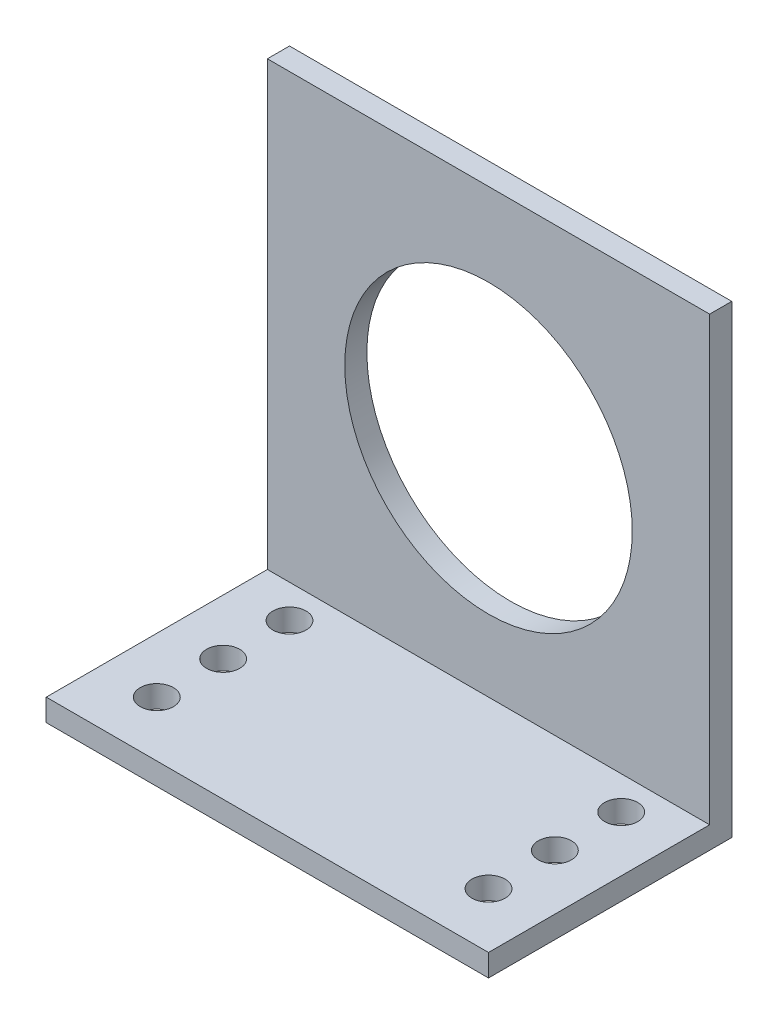
ISO-10303-21;
HEADER;
FILE_DESCRIPTION(('STEP AP214'),'2;1');
FILE_NAME('part.step','',(''),(''),'','','');
FILE_SCHEMA(('AUTOMOTIVE_DESIGN { 1 0 10303 214 1 1 1 1 }'));
ENDSEC;
DATA;
#1=APPLICATION_CONTEXT('core data for automotive mechanical design processes');
#2=APPLICATION_PROTOCOL_DEFINITION('international standard','automotive_design',2000,#1);
#3=PRODUCT_CONTEXT('',#1,'mechanical');
#4=PRODUCT('Part','Part','',(#3));
#5=PRODUCT_RELATED_PRODUCT_CATEGORY('part','',(#4));
#6=PRODUCT_DEFINITION_FORMATION('','',#4);
#7=PRODUCT_DEFINITION_CONTEXT('part definition',#1,'design');
#8=PRODUCT_DEFINITION('design','',#6,#7);
#9=PRODUCT_DEFINITION_SHAPE('','',#8);
#10=(LENGTH_UNIT() NAMED_UNIT(*) SI_UNIT(.MILLI.,.METRE.));
#11=(NAMED_UNIT(*) PLANE_ANGLE_UNIT() SI_UNIT($,.RADIAN.));
#12=(NAMED_UNIT(*) SI_UNIT($,.STERADIAN.) SOLID_ANGLE_UNIT());
#13=UNCERTAINTY_MEASURE_WITH_UNIT(LENGTH_MEASURE(1.E-05),#10,'distance_accuracy_value','');
#14=(GEOMETRIC_REPRESENTATION_CONTEXT(3) GLOBAL_UNCERTAINTY_ASSIGNED_CONTEXT((#13)) GLOBAL_UNIT_ASSIGNED_CONTEXT((#10,
#11,#12)) REPRESENTATION_CONTEXT('',''));
#15=CARTESIAN_POINT('',(0.,0.,0.));
#16=DIRECTION('',(0.,0.,1.));
#17=DIRECTION('',(1.,0.,0.));
#18=AXIS2_PLACEMENT_3D('',#15,#16,#17);
#19=CARTESIAN_POINT('',(40.,2.,0.));
#20=DIRECTION('',(0.,1.,0.));
#21=DIRECTION('',(0.,0.,1.));
#22=AXIS2_PLACEMENT_3D('',#19,#20,#21);
#23=PLANE('',#22);
#24=CARTESIAN_POINT('',(35.,2.,-17.));
#25=DIRECTION('',(0.,1.,0.));
#26=DIRECTION('',(0.,0.,1.));
#27=AXIS2_PLACEMENT_3D('',#24,#25,#26);
#28=CIRCLE('',#27,1.5);
#29=CARTESIAN_POINT('',(35.,2.,-15.5));
#30=VERTEX_POINT('',#29);
#31=EDGE_CURVE('E204',#30,#30,#28,.T.);
#32=ORIENTED_EDGE('',*,*,#31,.F.);
#33=EDGE_LOOP('',(#32));
#34=FACE_BOUND('',#33,.T.);
#35=CARTESIAN_POINT('',(35.,2.,-11.));
#36=DIRECTION('',(0.,1.,0.));
#37=DIRECTION('',(0.,0.,1.));
#38=AXIS2_PLACEMENT_3D('',#35,#36,#37);
#39=CIRCLE('',#38,1.5);
#40=CARTESIAN_POINT('',(35.,2.,-9.49999999999999));
#41=VERTEX_POINT('',#40);
#42=EDGE_CURVE('E198',#41,#41,#39,.T.);
#43=ORIENTED_EDGE('',*,*,#42,.F.);
#44=EDGE_LOOP('',(#43));
#45=FACE_BOUND('',#44,.T.);
#46=CARTESIAN_POINT('',(4.99999999999996,2.,-16.9999999999998));
#47=DIRECTION('',(0.,1.,0.));
#48=DIRECTION('',(0.,0.,1.));
#49=AXIS2_PLACEMENT_3D('',#46,#47,#48);
#50=CIRCLE('',#49,1.5);
#51=CARTESIAN_POINT('',(4.99999999999996,2.,-15.4999999999998));
#52=VERTEX_POINT('',#51);
#53=EDGE_CURVE('E192',#52,#52,#50,.T.);
#54=ORIENTED_EDGE('',*,*,#53,.F.);
#55=EDGE_LOOP('',(#54));
#56=FACE_BOUND('',#55,.T.);
#57=CARTESIAN_POINT('',(4.99999999999998,2.,-10.9999999999998));
#58=DIRECTION('',(0.,1.,0.));
#59=DIRECTION('',(0.,0.,1.));
#60=AXIS2_PLACEMENT_3D('',#57,#58,#59);
#61=CIRCLE('',#60,1.5);
#62=CARTESIAN_POINT('',(4.99999999999998,2.,-9.49999999999979));
#63=VERTEX_POINT('',#62);
#64=EDGE_CURVE('E186',#63,#63,#61,.T.);
#65=ORIENTED_EDGE('',*,*,#64,.F.);
#66=EDGE_LOOP('',(#65));
#67=FACE_BOUND('',#66,.T.);
#68=CARTESIAN_POINT('',(5.,2.,-4.99999999999979));
#69=DIRECTION('',(0.,1.,0.));
#70=DIRECTION('',(0.,0.,1.));
#71=AXIS2_PLACEMENT_3D('',#68,#69,#70);
#72=CIRCLE('',#71,1.5);
#73=CARTESIAN_POINT('',(5.,2.,-3.49999999999979));
#74=VERTEX_POINT('',#73);
#75=EDGE_CURVE('E180',#74,#74,#72,.T.);
#76=ORIENTED_EDGE('',*,*,#75,.F.);
#77=EDGE_LOOP('',(#76));
#78=FACE_BOUND('',#77,.T.);
#79=CARTESIAN_POINT('',(35.,2.,-5.));
#80=DIRECTION('',(0.,1.,0.));
#81=DIRECTION('',(0.,0.,1.));
#82=AXIS2_PLACEMENT_3D('',#79,#80,#81);
#83=CIRCLE('',#82,1.5);
#84=CARTESIAN_POINT('',(35.,2.,-3.5));
#85=VERTEX_POINT('',#84);
#86=EDGE_CURVE('E173',#85,#85,#83,.T.);
#87=ORIENTED_EDGE('',*,*,#86,.F.);
#88=EDGE_LOOP('',(#87));
#89=FACE_BOUND('',#88,.T.);
#90=DIRECTION('',(0.,0.,-1.));
#91=VECTOR('',#90,1.);
#92=CARTESIAN_POINT('',(0.,2.,0.));
#93=LINE('',#92,#91);
#94=CARTESIAN_POINT('',(0.,2.,0.));
#95=VERTEX_POINT('',#94);
#96=CARTESIAN_POINT('',(0.,2.,-20.));
#97=VERTEX_POINT('',#96);
#98=EDGE_CURVE('E116',#95,#97,#93,.T.);
#99=ORIENTED_EDGE('',*,*,#98,.F.);
#100=DIRECTION('',(-1.,0.,0.));
#101=VECTOR('',#100,1.);
#102=CARTESIAN_POINT('',(40.,2.,0.));
#103=LINE('',#102,#101);
#104=CARTESIAN_POINT('',(40.,2.,0.));
#105=VERTEX_POINT('',#104);
#106=EDGE_CURVE('E11',#105,#95,#103,.T.);
#107=ORIENTED_EDGE('',*,*,#106,.F.);
#108=DIRECTION('',(0.,0.,-1.));
#109=VECTOR('',#108,1.);
#110=CARTESIAN_POINT('',(40.,2.,0.));
#111=LINE('',#110,#109);
#112=CARTESIAN_POINT('',(40.,2.,-20.));
#113=VERTEX_POINT('',#112);
#114=EDGE_CURVE('E131',#105,#113,#111,.T.);
#115=ORIENTED_EDGE('',*,*,#114,.T.);
#116=DIRECTION('',(-1.,0.,0.));
#117=VECTOR('',#116,1.);
#118=CARTESIAN_POINT('',(40.,2.,-20.));
#119=LINE('',#118,#117);
#120=EDGE_CURVE('E35',#113,#97,#119,.T.);
#121=ORIENTED_EDGE('',*,*,#120,.T.);
#122=EDGE_LOOP('',(#99,#107,#115,#121));
#123=FACE_BOUND('',#122,.T.);
#124=ADVANCED_FACE('F32',(#34,#45,#56,#67,#78,#89,#123),#23,.T.);
#125=CARTESIAN_POINT('',(40.,0.,0.));
#126=DIRECTION('',(0.,0.,1.));
#127=DIRECTION('',(1.,0.,0.));
#128=AXIS2_PLACEMENT_3D('',#125,#126,#127);
#129=PLANE('',#128);
#130=DIRECTION('',(0.,1.,0.));
#131=VECTOR('',#130,1.);
#132=CARTESIAN_POINT('',(0.,0.,0.));
#133=LINE('',#132,#131);
#134=CARTESIAN_POINT('',(0.,0.,0.));
#135=VERTEX_POINT('',#134);
#136=EDGE_CURVE('E129',#135,#95,#133,.T.);
#137=ORIENTED_EDGE('',*,*,#136,.F.);
#138=DIRECTION('',(-1.,0.,0.));
#139=VECTOR('',#138,1.);
#140=CARTESIAN_POINT('',(40.,0.,0.));
#141=LINE('',#140,#139);
#142=CARTESIAN_POINT('',(40.,0.,0.));
#143=VERTEX_POINT('',#142);
#144=EDGE_CURVE('E41',#143,#135,#141,.T.);
#145=ORIENTED_EDGE('',*,*,#144,.F.);
#146=DIRECTION('',(0.,1.,0.));
#147=VECTOR('',#146,1.);
#148=CARTESIAN_POINT('',(40.,0.,0.));
#149=LINE('',#148,#147);
#150=EDGE_CURVE('E96',#143,#105,#149,.T.);
#151=ORIENTED_EDGE('',*,*,#150,.T.);
#152=ORIENTED_EDGE('',*,*,#106,.T.);
#153=EDGE_LOOP('',(#137,#145,#151,#152));
#154=FACE_BOUND('',#153,.T.);
#155=ADVANCED_FACE('F140',(#154),#129,.T.);
#156=CARTESIAN_POINT('',(40.,0.,0.));
#157=DIRECTION('',(0.,1.,0.));
#158=DIRECTION('',(0.,0.,1.));
#159=AXIS2_PLACEMENT_3D('',#156,#157,#158);
#160=PLANE('',#159);
#161=CARTESIAN_POINT('',(35.,0.,-17.));
#162=DIRECTION('',(0.,1.,0.));
#163=DIRECTION('',(0.,0.,1.));
#164=AXIS2_PLACEMENT_3D('',#161,#162,#163);
#165=CIRCLE('',#164,1.5);
#166=CARTESIAN_POINT('',(35.,0.,-15.5));
#167=VERTEX_POINT('',#166);
#168=EDGE_CURVE('E201',#167,#167,#165,.T.);
#169=ORIENTED_EDGE('',*,*,#168,.T.);
#170=EDGE_LOOP('',(#169));
#171=FACE_BOUND('',#170,.T.);
#172=CARTESIAN_POINT('',(35.,0.,-11.));
#173=DIRECTION('',(0.,1.,0.));
#174=DIRECTION('',(0.,0.,1.));
#175=AXIS2_PLACEMENT_3D('',#172,#173,#174);
#176=CIRCLE('',#175,1.5);
#177=CARTESIAN_POINT('',(35.,0.,-9.49999999999999));
#178=VERTEX_POINT('',#177);
#179=EDGE_CURVE('E195',#178,#178,#176,.T.);
#180=ORIENTED_EDGE('',*,*,#179,.T.);
#181=EDGE_LOOP('',(#180));
#182=FACE_BOUND('',#181,.T.);
#183=CARTESIAN_POINT('',(4.99999999999996,0.,-16.9999999999998));
#184=DIRECTION('',(0.,1.,0.));
#185=DIRECTION('',(0.,0.,1.));
#186=AXIS2_PLACEMENT_3D('',#183,#184,#185);
#187=CIRCLE('',#186,1.5);
#188=CARTESIAN_POINT('',(4.99999999999996,0.,-15.4999999999998));
#189=VERTEX_POINT('',#188);
#190=EDGE_CURVE('E189',#189,#189,#187,.T.);
#191=ORIENTED_EDGE('',*,*,#190,.T.);
#192=EDGE_LOOP('',(#191));
#193=FACE_BOUND('',#192,.T.);
#194=CARTESIAN_POINT('',(4.99999999999998,0.,-10.9999999999998));
#195=DIRECTION('',(0.,1.,0.));
#196=DIRECTION('',(0.,0.,1.));
#197=AXIS2_PLACEMENT_3D('',#194,#195,#196);
#198=CIRCLE('',#197,1.5);
#199=CARTESIAN_POINT('',(4.99999999999998,0.,-9.49999999999979));
#200=VERTEX_POINT('',#199);
#201=EDGE_CURVE('E183',#200,#200,#198,.T.);
#202=ORIENTED_EDGE('',*,*,#201,.T.);
#203=EDGE_LOOP('',(#202));
#204=FACE_BOUND('',#203,.T.);
#205=CARTESIAN_POINT('',(5.,0.,-4.99999999999979));
#206=DIRECTION('',(0.,1.,0.));
#207=DIRECTION('',(0.,0.,1.));
#208=AXIS2_PLACEMENT_3D('',#205,#206,#207);
#209=CIRCLE('',#208,1.5);
#210=CARTESIAN_POINT('',(5.,0.,-3.49999999999979));
#211=VERTEX_POINT('',#210);
#212=EDGE_CURVE('E178',#211,#211,#209,.T.);
#213=ORIENTED_EDGE('',*,*,#212,.T.);
#214=EDGE_LOOP('',(#213));
#215=FACE_BOUND('',#214,.T.);
#216=CARTESIAN_POINT('',(35.,0.,-5.));
#217=DIRECTION('',(0.,1.,0.));
#218=DIRECTION('',(0.,0.,1.));
#219=AXIS2_PLACEMENT_3D('',#216,#217,#218);
#220=CIRCLE('',#219,1.5);
#221=CARTESIAN_POINT('',(35.,0.,-3.5));
#222=VERTEX_POINT('',#221);
#223=EDGE_CURVE('E168',#222,#222,#220,.T.);
#224=ORIENTED_EDGE('',*,*,#223,.T.);
#225=EDGE_LOOP('',(#224));
#226=FACE_BOUND('',#225,.T.);
#227=DIRECTION('',(0.,0.,-1.));
#228=VECTOR('',#227,1.);
#229=CARTESIAN_POINT('',(0.,0.,0.));
#230=LINE('',#229,#228);
#231=CARTESIAN_POINT('',(0.,0.,-22.));
#232=VERTEX_POINT('',#231);
#233=EDGE_CURVE('E101',#135,#232,#230,.T.);
#234=ORIENTED_EDGE('',*,*,#233,.T.);
#235=DIRECTION('',(-1.,0.,0.));
#236=VECTOR('',#235,1.);
#237=CARTESIAN_POINT('',(40.,0.,-22.));
#238=LINE('',#237,#236);
#239=CARTESIAN_POINT('',(40.,0.,-22.));
#240=VERTEX_POINT('',#239);
#241=EDGE_CURVE('E99',#240,#232,#238,.T.);
#242=ORIENTED_EDGE('',*,*,#241,.F.);
#243=DIRECTION('',(0.,0.,-1.));
#244=VECTOR('',#243,1.);
#245=CARTESIAN_POINT('',(40.,0.,0.));
#246=LINE('',#245,#244);
#247=EDGE_CURVE('E90',#143,#240,#246,.T.);
#248=ORIENTED_EDGE('',*,*,#247,.F.);
#249=ORIENTED_EDGE('',*,*,#144,.T.);
#250=EDGE_LOOP('',(#234,#242,#248,#249));
#251=FACE_BOUND('',#250,.T.);
#252=ADVANCED_FACE('F100',(#171,#182,#193,#204,#215,#226,#251),#160,.F.);
#253=CARTESIAN_POINT('',(40.,0.,-22.));
#254=DIRECTION('',(0.,0.,1.));
#255=DIRECTION('',(1.,0.,0.));
#256=AXIS2_PLACEMENT_3D('',#253,#254,#255);
#257=PLANE('',#256);
#258=CARTESIAN_POINT('',(20.,21.5,-22.));
#259=DIRECTION('',(0.,0.,1.));
#260=DIRECTION('',(1.,0.,0.));
#261=AXIS2_PLACEMENT_3D('',#258,#259,#260);
#262=CIRCLE('',#261,13.);
#263=CARTESIAN_POINT('',(33.,21.5,-22.));
#264=VERTEX_POINT('',#263);
#265=EDGE_CURVE('E120',#264,#264,#262,.T.);
#266=ORIENTED_EDGE('',*,*,#265,.T.);
#267=EDGE_LOOP('',(#266));
#268=FACE_BOUND('',#267,.T.);
#269=DIRECTION('',(0.,1.,0.));
#270=VECTOR('',#269,1.);
#271=CARTESIAN_POINT('',(0.,0.,-22.));
#272=LINE('',#271,#270);
#273=CARTESIAN_POINT('',(0.,42.,-22.));
#274=VERTEX_POINT('',#273);
#275=EDGE_CURVE('E126',#232,#274,#272,.T.);
#276=ORIENTED_EDGE('',*,*,#275,.T.);
#277=DIRECTION('',(-1.,0.,0.));
#278=VECTOR('',#277,1.);
#279=CARTESIAN_POINT('',(40.,42.,-22.));
#280=LINE('',#279,#278);
#281=CARTESIAN_POINT('',(40.,42.,-22.));
#282=VERTEX_POINT('',#281);
#283=EDGE_CURVE('E104',#282,#274,#280,.T.);
#284=ORIENTED_EDGE('',*,*,#283,.F.);
#285=DIRECTION('',(0.,1.,0.));
#286=VECTOR('',#285,1.);
#287=CARTESIAN_POINT('',(40.,0.,-22.));
#288=LINE('',#287,#286);
#289=EDGE_CURVE('E94',#240,#282,#288,.T.);
#290=ORIENTED_EDGE('',*,*,#289,.F.);
#291=ORIENTED_EDGE('',*,*,#241,.T.);
#292=EDGE_LOOP('',(#276,#284,#290,#291));
#293=FACE_BOUND('',#292,.T.);
#294=ADVANCED_FACE('F106',(#268,#293),#257,.F.);
#295=CARTESIAN_POINT('',(40.,42.,-22.));
#296=DIRECTION('',(0.,-1.,0.));
#297=DIRECTION('',(0.,0.,-1.));
#298=AXIS2_PLACEMENT_3D('',#295,#296,#297);
#299=PLANE('',#298);
#300=DIRECTION('',(0.,0.,1.));
#301=VECTOR('',#300,1.);
#302=CARTESIAN_POINT('',(0.,42.,-22.));
#303=LINE('',#302,#301);
#304=CARTESIAN_POINT('',(0.,42.,-20.));
#305=VERTEX_POINT('',#304);
#306=EDGE_CURVE('E123',#274,#305,#303,.T.);
#307=ORIENTED_EDGE('',*,*,#306,.T.);
#308=DIRECTION('',(-1.,0.,0.));
#309=VECTOR('',#308,1.);
#310=CARTESIAN_POINT('',(40.,42.,-20.));
#311=LINE('',#310,#309);
#312=CARTESIAN_POINT('',(40.,42.,-20.));
#313=VERTEX_POINT('',#312);
#314=EDGE_CURVE('E134',#313,#305,#311,.T.);
#315=ORIENTED_EDGE('',*,*,#314,.F.);
#316=DIRECTION('',(0.,0.,1.));
#317=VECTOR('',#316,1.);
#318=CARTESIAN_POINT('',(40.,42.,-22.));
#319=LINE('',#318,#317);
#320=EDGE_CURVE('E109',#282,#313,#319,.T.);
#321=ORIENTED_EDGE('',*,*,#320,.F.);
#322=ORIENTED_EDGE('',*,*,#283,.T.);
#323=EDGE_LOOP('',(#307,#315,#321,#322));
#324=FACE_BOUND('',#323,.T.);
#325=ADVANCED_FACE('F155',(#324),#299,.F.);
#326=CARTESIAN_POINT('',(40.,2.,-20.));
#327=DIRECTION('',(0.,0.,1.));
#328=DIRECTION('',(1.,0.,0.));
#329=AXIS2_PLACEMENT_3D('',#326,#327,#328);
#330=PLANE('',#329);
#331=CARTESIAN_POINT('',(20.,21.5,-20.));
#332=DIRECTION('',(0.,0.,1.));
#333=DIRECTION('',(1.,0.,0.));
#334=AXIS2_PLACEMENT_3D('',#331,#332,#333);
#335=CIRCLE('',#334,13.);
#336=CARTESIAN_POINT('',(33.,21.5,-20.));
#337=VERTEX_POINT('',#336);
#338=EDGE_CURVE('E166',#337,#337,#335,.T.);
#339=ORIENTED_EDGE('',*,*,#338,.F.);
#340=EDGE_LOOP('',(#339));
#341=FACE_BOUND('',#340,.T.);
#342=DIRECTION('',(0.,1.,0.));
#343=VECTOR('',#342,1.);
#344=CARTESIAN_POINT('',(0.,2.,-20.));
#345=LINE('',#344,#343);
#346=EDGE_CURVE('E119',#97,#305,#345,.T.);
#347=ORIENTED_EDGE('',*,*,#346,.F.);
#348=ORIENTED_EDGE('',*,*,#120,.F.);
#349=DIRECTION('',(0.,1.,0.));
#350=VECTOR('',#349,1.);
#351=CARTESIAN_POINT('',(40.,2.,-20.));
#352=LINE('',#351,#350);
#353=EDGE_CURVE('E111',#113,#313,#352,.T.);
#354=ORIENTED_EDGE('',*,*,#353,.T.);
#355=ORIENTED_EDGE('',*,*,#314,.T.);
#356=EDGE_LOOP('',(#347,#348,#354,#355));
#357=FACE_BOUND('',#356,.T.);
#358=ADVANCED_FACE('F136',(#341,#357),#330,.T.);
#359=CARTESIAN_POINT('',(40.,0.,0.));
#360=DIRECTION('',(1.,0.,0.));
#361=DIRECTION('',(0.,0.,-1.));
#362=AXIS2_PLACEMENT_3D('',#359,#360,#361);
#363=PLANE('',#362);
#364=ORIENTED_EDGE('',*,*,#114,.F.);
#365=ORIENTED_EDGE('',*,*,#150,.F.);
#366=ORIENTED_EDGE('',*,*,#247,.T.);
#367=ORIENTED_EDGE('',*,*,#289,.T.);
#368=ORIENTED_EDGE('',*,*,#320,.T.);
#369=ORIENTED_EDGE('',*,*,#353,.F.);
#370=EDGE_LOOP('',(#364,#365,#366,#367,#368,#369));
#371=FACE_BOUND('',#370,.T.);
#372=ADVANCED_FACE('F92',(#371),#363,.T.);
#373=CARTESIAN_POINT('',(0.,0.,0.));
#374=DIRECTION('',(1.,0.,0.));
#375=DIRECTION('',(0.,0.,-1.));
#376=AXIS2_PLACEMENT_3D('',#373,#374,#375);
#377=PLANE('',#376);
#378=ORIENTED_EDGE('',*,*,#98,.T.);
#379=ORIENTED_EDGE('',*,*,#346,.T.);
#380=ORIENTED_EDGE('',*,*,#306,.F.);
#381=ORIENTED_EDGE('',*,*,#275,.F.);
#382=ORIENTED_EDGE('',*,*,#233,.F.);
#383=ORIENTED_EDGE('',*,*,#136,.T.);
#384=EDGE_LOOP('',(#378,#379,#380,#381,#382,#383));
#385=FACE_BOUND('',#384,.T.);
#386=ADVANCED_FACE('F139',(#385),#377,.F.);
#387=CARTESIAN_POINT('',(20.,21.5,-22.));
#388=DIRECTION('',(0.,0.,1.));
#389=DIRECTION('',(1.,0.,0.));
#390=AXIS2_PLACEMENT_3D('',#387,#388,#389);
#391=CYLINDRICAL_SURFACE('',#390,13.);
#392=ORIENTED_EDGE('',*,*,#265,.F.);
#393=EDGE_LOOP('',(#392));
#394=FACE_BOUND('',#393,.T.);
#395=ORIENTED_EDGE('',*,*,#338,.T.);
#396=EDGE_LOOP('',(#395));
#397=FACE_BOUND('',#396,.T.);
#398=ADVANCED_FACE('F231',(#394,#397),#391,.F.);
#399=CARTESIAN_POINT('',(35.,0.,-5.));
#400=DIRECTION('',(0.,1.,0.));
#401=DIRECTION('',(0.,0.,1.));
#402=AXIS2_PLACEMENT_3D('',#399,#400,#401);
#403=CYLINDRICAL_SURFACE('',#402,1.5);
#404=ORIENTED_EDGE('',*,*,#223,.F.);
#405=EDGE_LOOP('',(#404));
#406=FACE_BOUND('',#405,.T.);
#407=ORIENTED_EDGE('',*,*,#86,.T.);
#408=EDGE_LOOP('',(#407));
#409=FACE_BOUND('',#408,.T.);
#410=ADVANCED_FACE('F228',(#406,#409),#403,.F.);
#411=CARTESIAN_POINT('',(5.,0.,-4.99999999999979));
#412=DIRECTION('',(0.,1.,0.));
#413=DIRECTION('',(0.,0.,1.));
#414=AXIS2_PLACEMENT_3D('',#411,#412,#413);
#415=CYLINDRICAL_SURFACE('',#414,1.5);
#416=ORIENTED_EDGE('',*,*,#212,.F.);
#417=EDGE_LOOP('',(#416));
#418=FACE_BOUND('',#417,.T.);
#419=ORIENTED_EDGE('',*,*,#75,.T.);
#420=EDGE_LOOP('',(#419));
#421=FACE_BOUND('',#420,.T.);
#422=ADVANCED_FACE('F230',(#418,#421),#415,.F.);
#423=CARTESIAN_POINT('',(4.99999999999998,0.,-10.9999999999998));
#424=DIRECTION('',(0.,1.,0.));
#425=DIRECTION('',(0.,0.,1.));
#426=AXIS2_PLACEMENT_3D('',#423,#424,#425);
#427=CYLINDRICAL_SURFACE('',#426,1.5);
#428=ORIENTED_EDGE('',*,*,#201,.F.);
#429=EDGE_LOOP('',(#428));
#430=FACE_BOUND('',#429,.T.);
#431=ORIENTED_EDGE('',*,*,#64,.T.);
#432=EDGE_LOOP('',(#431));
#433=FACE_BOUND('',#432,.T.);
#434=ADVANCED_FACE('F238',(#430,#433),#427,.F.);
#435=CARTESIAN_POINT('',(4.99999999999996,0.,-16.9999999999998));
#436=DIRECTION('',(0.,1.,0.));
#437=DIRECTION('',(0.,0.,1.));
#438=AXIS2_PLACEMENT_3D('',#435,#436,#437);
#439=CYLINDRICAL_SURFACE('',#438,1.5);
#440=ORIENTED_EDGE('',*,*,#190,.F.);
#441=EDGE_LOOP('',(#440));
#442=FACE_BOUND('',#441,.T.);
#443=ORIENTED_EDGE('',*,*,#53,.T.);
#444=EDGE_LOOP('',(#443));
#445=FACE_BOUND('',#444,.T.);
#446=ADVANCED_FACE('F247',(#442,#445),#439,.F.);
#447=CARTESIAN_POINT('',(35.,0.,-11.));
#448=DIRECTION('',(0.,1.,0.));
#449=DIRECTION('',(0.,0.,1.));
#450=AXIS2_PLACEMENT_3D('',#447,#448,#449);
#451=CYLINDRICAL_SURFACE('',#450,1.5);
#452=ORIENTED_EDGE('',*,*,#179,.F.);
#453=EDGE_LOOP('',(#452));
#454=FACE_BOUND('',#453,.T.);
#455=ORIENTED_EDGE('',*,*,#42,.T.);
#456=EDGE_LOOP('',(#455));
#457=FACE_BOUND('',#456,.T.);
#458=ADVANCED_FACE('F214',(#454,#457),#451,.F.);
#459=CARTESIAN_POINT('',(35.,0.,-17.));
#460=DIRECTION('',(0.,1.,0.));
#461=DIRECTION('',(0.,0.,1.));
#462=AXIS2_PLACEMENT_3D('',#459,#460,#461);
#463=CYLINDRICAL_SURFACE('',#462,1.5);
#464=ORIENTED_EDGE('',*,*,#168,.F.);
#465=EDGE_LOOP('',(#464));
#466=FACE_BOUND('',#465,.T.);
#467=ORIENTED_EDGE('',*,*,#31,.T.);
#468=EDGE_LOOP('',(#467));
#469=FACE_BOUND('',#468,.T.);
#470=ADVANCED_FACE('F211',(#466,#469),#463,.F.);
#471=CLOSED_SHELL('',(#124,#155,#252,#294,#325,#358,#372,#386,#398,#410,#422,#434,#446,#458,#470));
#472=MANIFOLD_SOLID_BREP('B2',#471);
#473=ADVANCED_BREP_SHAPE_REPRESENTATION('',(#18,#472),#14);
#474=SHAPE_DEFINITION_REPRESENTATION(#9,#473);
ENDSEC;
END-ISO-10303-21;
